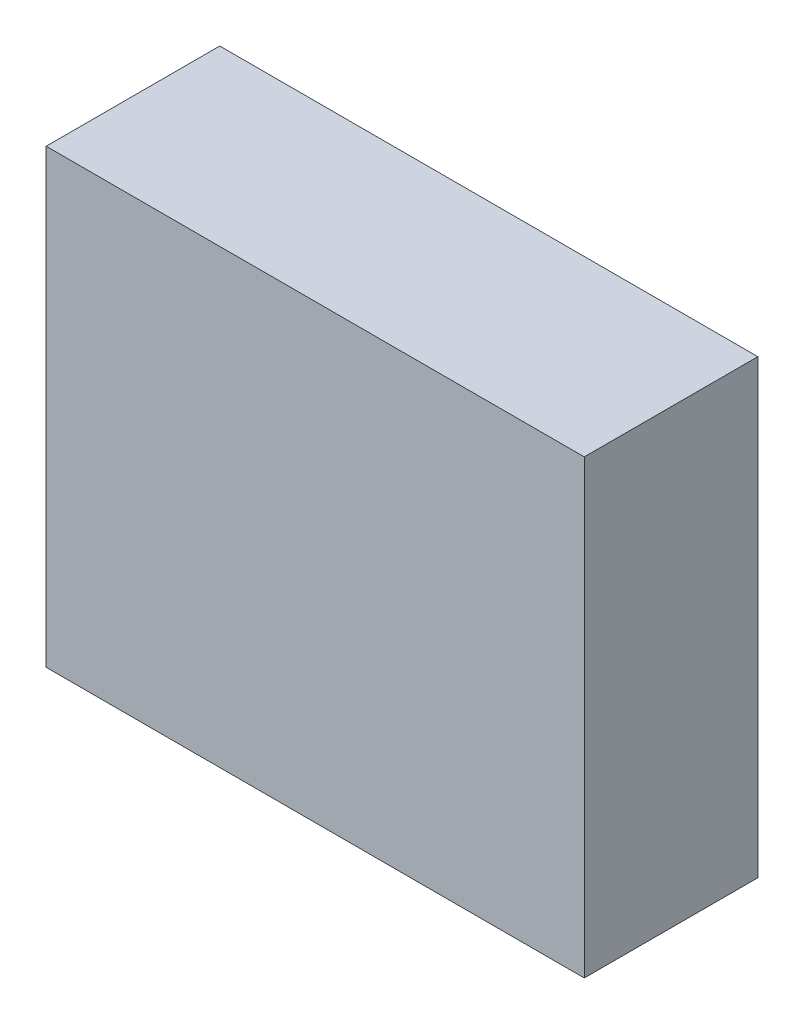
ISO-10303-21;
HEADER;
FILE_DESCRIPTION(('STEP AP214'),'2;1');
FILE_NAME('part.step','',(''),(''),'','','');
FILE_SCHEMA(('AUTOMOTIVE_DESIGN { 1 0 10303 214 1 1 1 1 }'));
ENDSEC;
DATA;
#1=APPLICATION_CONTEXT('core data for automotive mechanical design processes');
#2=APPLICATION_PROTOCOL_DEFINITION('international standard','automotive_design',2000,#1);
#3=PRODUCT_CONTEXT('',#1,'mechanical');
#4=PRODUCT('Part','Part','',(#3));
#5=PRODUCT_RELATED_PRODUCT_CATEGORY('part','',(#4));
#6=PRODUCT_DEFINITION_FORMATION('','',#4);
#7=PRODUCT_DEFINITION_CONTEXT('part definition',#1,'design');
#8=PRODUCT_DEFINITION('design','',#6,#7);
#9=PRODUCT_DEFINITION_SHAPE('','',#8);
#10=(LENGTH_UNIT() NAMED_UNIT(*) SI_UNIT(.MILLI.,.METRE.));
#11=(NAMED_UNIT(*) PLANE_ANGLE_UNIT() SI_UNIT($,.RADIAN.));
#12=(NAMED_UNIT(*) SI_UNIT($,.STERADIAN.) SOLID_ANGLE_UNIT());
#13=UNCERTAINTY_MEASURE_WITH_UNIT(LENGTH_MEASURE(1.E-05),#10,'distance_accuracy_value','');
#14=(GEOMETRIC_REPRESENTATION_CONTEXT(3) GLOBAL_UNCERTAINTY_ASSIGNED_CONTEXT((#13)) GLOBAL_UNIT_ASSIGNED_CONTEXT((#10,
#11,#12)) REPRESENTATION_CONTEXT('',''));
#15=CARTESIAN_POINT('',(0.,0.,0.));
#16=DIRECTION('',(0.,0.,1.));
#17=DIRECTION('',(1.,0.,0.));
#18=AXIS2_PLACEMENT_3D('',#15,#16,#17);
#19=CARTESIAN_POINT('',(0.77499972,0.65000124,0.499999));
#20=DIRECTION('',(0.,0.,1.));
#21=DIRECTION('',(1.,0.,0.));
#22=AXIS2_PLACEMENT_3D('',#19,#20,#21);
#23=PLANE('',#22);
#24=DIRECTION('',(1.,0.,0.));
#25=VECTOR('',#24,1.);
#26=CARTESIAN_POINT('',(0.77499972,-0.65000124,0.499999));
#27=LINE('',#26,#25);
#28=CARTESIAN_POINT('',(0.77499972,-0.65000124,0.499999));
#29=VERTEX_POINT('',#28);
#30=CARTESIAN_POINT('',(-0.77499972,-0.65000124,0.499999));
#31=VERTEX_POINT('',#30);
#32=EDGE_CURVE('E53',#29,#31,#27,.F.);
#33=ORIENTED_EDGE('',*,*,#32,.F.);
#34=DIRECTION('',(0.,1.,0.));
#35=VECTOR('',#34,1.);
#36=CARTESIAN_POINT('',(0.77499972,0.65000124,0.499999));
#37=LINE('',#36,#35);
#38=CARTESIAN_POINT('',(0.77499972,0.65000124,0.499999));
#39=VERTEX_POINT('',#38);
#40=EDGE_CURVE('E68',#39,#29,#37,.F.);
#41=ORIENTED_EDGE('',*,*,#40,.F.);
#42=DIRECTION('',(1.,0.,0.));
#43=VECTOR('',#42,1.);
#44=CARTESIAN_POINT('',(-0.77499972,0.65000124,0.499999));
#45=LINE('',#44,#43);
#46=CARTESIAN_POINT('',(-0.77499972,0.65000124,0.499999));
#47=VERTEX_POINT('',#46);
#48=EDGE_CURVE('E20',#47,#39,#45,.T.);
#49=ORIENTED_EDGE('',*,*,#48,.F.);
#50=DIRECTION('',(0.,1.,0.));
#51=VECTOR('',#50,1.);
#52=CARTESIAN_POINT('',(-0.77499972,-0.65000124,0.499999));
#53=LINE('',#52,#51);
#54=EDGE_CURVE('E58',#31,#47,#53,.T.);
#55=ORIENTED_EDGE('',*,*,#54,.F.);
#56=EDGE_LOOP('',(#33,#41,#49,#55));
#57=FACE_BOUND('',#56,.T.);
#58=ADVANCED_FACE('F17',(#57),#23,.T.);
#59=CARTESIAN_POINT('',(-0.77499972,0.65000124,0.));
#60=DIRECTION('',(0.,1.,0.));
#61=DIRECTION('',(0.,0.,1.));
#62=AXIS2_PLACEMENT_3D('',#59,#60,#61);
#63=PLANE('',#62);
#64=DIRECTION('',(0.,0.,-1.));
#65=VECTOR('',#64,1.);
#66=CARTESIAN_POINT('',(0.77499972,0.65000124,0.));
#67=LINE('',#66,#65);
#68=CARTESIAN_POINT('',(0.77499972,0.65000124,0.));
#69=VERTEX_POINT('',#68);
#70=EDGE_CURVE('E79',#69,#39,#67,.F.);
#71=ORIENTED_EDGE('',*,*,#70,.F.);
#72=DIRECTION('',(1.,0.,0.));
#73=VECTOR('',#72,1.);
#74=CARTESIAN_POINT('',(0.77499972,0.65000124,0.));
#75=LINE('',#74,#73);
#76=CARTESIAN_POINT('',(-0.77499972,0.65000124,0.));
#77=VERTEX_POINT('',#76);
#78=EDGE_CURVE('E74',#69,#77,#75,.F.);
#79=ORIENTED_EDGE('',*,*,#78,.T.);
#80=DIRECTION('',(0.,0.,1.));
#81=VECTOR('',#80,1.);
#82=CARTESIAN_POINT('',(-0.77499972,0.65000124,0.));
#83=LINE('',#82,#81);
#84=EDGE_CURVE('E63',#47,#77,#83,.F.);
#85=ORIENTED_EDGE('',*,*,#84,.F.);
#86=ORIENTED_EDGE('',*,*,#48,.T.);
#87=EDGE_LOOP('',(#71,#79,#85,#86));
#88=FACE_BOUND('',#87,.T.);
#89=ADVANCED_FACE('F73',(#88),#63,.T.);
#90=CARTESIAN_POINT('',(-0.77499972,-0.65000124,0.));
#91=DIRECTION('',(-1.,0.,0.));
#92=DIRECTION('',(0.,0.,1.));
#93=AXIS2_PLACEMENT_3D('',#90,#91,#92);
#94=PLANE('',#93);
#95=ORIENTED_EDGE('',*,*,#84,.T.);
#96=DIRECTION('',(0.,1.,0.));
#97=VECTOR('',#96,1.);
#98=CARTESIAN_POINT('',(-0.77499972,0.65000124,0.));
#99=LINE('',#98,#97);
#100=CARTESIAN_POINT('',(-0.77499972,-0.65000124,0.));
#101=VERTEX_POINT('',#100);
#102=EDGE_CURVE('E84',#77,#101,#99,.F.);
#103=ORIENTED_EDGE('',*,*,#102,.T.);
#104=DIRECTION('',(0.,0.,-1.));
#105=VECTOR('',#104,1.);
#106=CARTESIAN_POINT('',(-0.77499972,-0.65000124,0.));
#107=LINE('',#106,#105);
#108=EDGE_CURVE('E65',#31,#101,#107,.T.);
#109=ORIENTED_EDGE('',*,*,#108,.F.);
#110=ORIENTED_EDGE('',*,*,#54,.T.);
#111=EDGE_LOOP('',(#95,#103,#109,#110));
#112=FACE_BOUND('',#111,.T.);
#113=ADVANCED_FACE('F60',(#112),#94,.T.);
#114=CARTESIAN_POINT('',(0.77499972,-0.65000124,0.));
#115=DIRECTION('',(0.,-1.,0.));
#116=DIRECTION('',(0.,0.,-1.));
#117=AXIS2_PLACEMENT_3D('',#114,#115,#116);
#118=PLANE('',#117);
#119=ORIENTED_EDGE('',*,*,#108,.T.);
#120=DIRECTION('',(1.,0.,0.));
#121=VECTOR('',#120,1.);
#122=CARTESIAN_POINT('',(0.77499972,-0.65000124,0.));
#123=LINE('',#122,#121);
#124=CARTESIAN_POINT('',(0.77499972,-0.65000124,0.));
#125=VERTEX_POINT('',#124);
#126=EDGE_CURVE('E26',#101,#125,#123,.T.);
#127=ORIENTED_EDGE('',*,*,#126,.T.);
#128=DIRECTION('',(0.,0.,-1.));
#129=VECTOR('',#128,1.);
#130=CARTESIAN_POINT('',(0.77499972,-0.65000124,0.));
#131=LINE('',#130,#129);
#132=EDGE_CURVE('E34',#29,#125,#131,.T.);
#133=ORIENTED_EDGE('',*,*,#132,.F.);
#134=ORIENTED_EDGE('',*,*,#32,.T.);
#135=EDGE_LOOP('',(#119,#127,#133,#134));
#136=FACE_BOUND('',#135,.T.);
#137=ADVANCED_FACE('F88',(#136),#118,.T.);
#138=CARTESIAN_POINT('',(0.77499972,0.65000124,0.));
#139=DIRECTION('',(1.,0.,0.));
#140=DIRECTION('',(0.,0.,-1.));
#141=AXIS2_PLACEMENT_3D('',#138,#139,#140);
#142=PLANE('',#141);
#143=ORIENTED_EDGE('',*,*,#132,.T.);
#144=DIRECTION('',(0.,1.,0.));
#145=VECTOR('',#144,1.);
#146=CARTESIAN_POINT('',(0.77499972,0.65000124,0.));
#147=LINE('',#146,#145);
#148=EDGE_CURVE('E11',#125,#69,#147,.T.);
#149=ORIENTED_EDGE('',*,*,#148,.T.);
#150=ORIENTED_EDGE('',*,*,#70,.T.);
#151=ORIENTED_EDGE('',*,*,#40,.T.);
#152=EDGE_LOOP('',(#143,#149,#150,#151));
#153=FACE_BOUND('',#152,.T.);
#154=ADVANCED_FACE('F91',(#153),#142,.T.);
#155=CARTESIAN_POINT('',(0.77499972,0.65000124,0.));
#156=DIRECTION('',(0.,0.,1.));
#157=DIRECTION('',(1.,0.,0.));
#158=AXIS2_PLACEMENT_3D('',#155,#156,#157);
#159=PLANE('',#158);
#160=ORIENTED_EDGE('',*,*,#126,.F.);
#161=ORIENTED_EDGE('',*,*,#102,.F.);
#162=ORIENTED_EDGE('',*,*,#78,.F.);
#163=ORIENTED_EDGE('',*,*,#148,.F.);
#164=EDGE_LOOP('',(#160,#161,#162,#163));
#165=FACE_BOUND('',#164,.T.);
#166=ADVANCED_FACE('F90',(#165),#159,.F.);
#167=CLOSED_SHELL('',(#58,#89,#113,#137,#154,#166));
#168=MANIFOLD_SOLID_BREP('B1',#167);
#169=ADVANCED_BREP_SHAPE_REPRESENTATION('',(#18,#168),#14);
#170=SHAPE_DEFINITION_REPRESENTATION(#9,#169);
ENDSEC;
END-ISO-10303-21;
